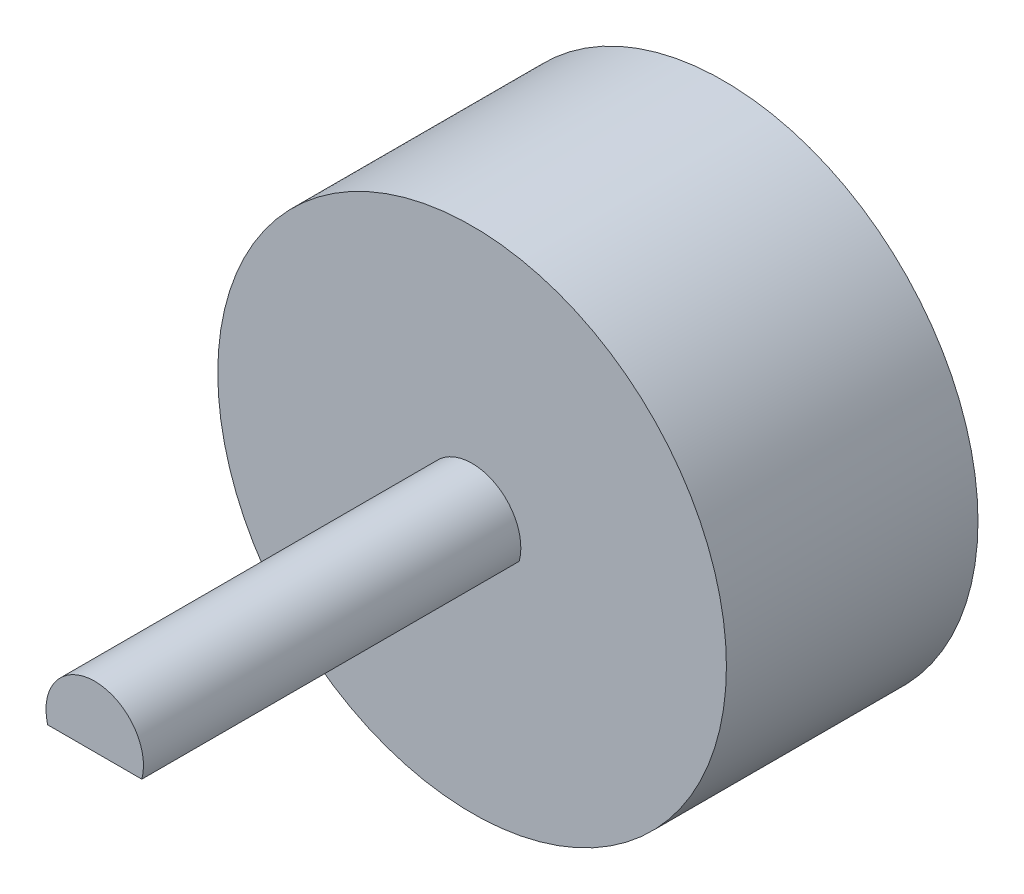
ISO-10303-21;
HEADER;
FILE_DESCRIPTION(('STEP AP214'),'2;1');
FILE_NAME('part.step','',(''),(''),'','','');
FILE_SCHEMA(('AUTOMOTIVE_DESIGN { 1 0 10303 214 1 1 1 1 }'));
ENDSEC;
DATA;
#1=APPLICATION_CONTEXT('core data for automotive mechanical design processes');
#2=APPLICATION_PROTOCOL_DEFINITION('international standard','automotive_design',2000,#1);
#3=PRODUCT_CONTEXT('',#1,'mechanical');
#4=PRODUCT('Part','Part','',(#3));
#5=PRODUCT_RELATED_PRODUCT_CATEGORY('part','',(#4));
#6=PRODUCT_DEFINITION_FORMATION('','',#4);
#7=PRODUCT_DEFINITION_CONTEXT('part definition',#1,'design');
#8=PRODUCT_DEFINITION('design','',#6,#7);
#9=PRODUCT_DEFINITION_SHAPE('','',#8);
#10=(LENGTH_UNIT() NAMED_UNIT(*) SI_UNIT(.MILLI.,.METRE.));
#11=(NAMED_UNIT(*) PLANE_ANGLE_UNIT() SI_UNIT($,.RADIAN.));
#12=(NAMED_UNIT(*) SI_UNIT($,.STERADIAN.) SOLID_ANGLE_UNIT());
#13=UNCERTAINTY_MEASURE_WITH_UNIT(LENGTH_MEASURE(1.E-05),#10,'distance_accuracy_value','');
#14=(GEOMETRIC_REPRESENTATION_CONTEXT(3) GLOBAL_UNCERTAINTY_ASSIGNED_CONTEXT((#13)) GLOBAL_UNIT_ASSIGNED_CONTEXT((#10,
#11,#12)) REPRESENTATION_CONTEXT('',''));
#15=CARTESIAN_POINT('',(0.,0.,0.));
#16=DIRECTION('',(0.,0.,1.));
#17=DIRECTION('',(1.,0.,0.));
#18=AXIS2_PLACEMENT_3D('',#15,#16,#17);
#19=CARTESIAN_POINT('',(0.,0.,16.));
#20=DIRECTION('',(0.,0.,1.));
#21=DIRECTION('',(1.,0.,0.));
#22=AXIS2_PLACEMENT_3D('',#19,#20,#21);
#23=PLANE('',#22);
#24=CARTESIAN_POINT('',(0.,0.,16.));
#25=DIRECTION('',(0.,0.,1.));
#26=DIRECTION('',(1.,0.,0.));
#27=AXIS2_PLACEMENT_3D('',#24,#25,#26);
#28=CIRCLE('',#27,16.175);
#29=CARTESIAN_POINT('',(16.175,0.,16.));
#30=VERTEX_POINT('',#29);
#31=EDGE_CURVE('E11',#30,#30,#28,.T.);
#32=ORIENTED_EDGE('',*,*,#31,.T.);
#33=EDGE_LOOP('',(#32));
#34=FACE_BOUND('',#33,.T.);
#35=DIRECTION('',(-1.,0.,0.));
#36=VECTOR('',#35,1.);
#37=CARTESIAN_POINT('',(0.,-0.799984374847408,16.));
#38=LINE('',#37,#36);
#39=CARTESIAN_POINT('',(2.995,-0.799984374847408,16.));
#40=VERTEX_POINT('',#39);
#41=CARTESIAN_POINT('',(-2.995,-0.799984374847408,16.));
#42=VERTEX_POINT('',#41);
#43=EDGE_CURVE('E53',#40,#42,#38,.T.);
#44=ORIENTED_EDGE('',*,*,#43,.T.);
#45=CARTESIAN_POINT('',(0.,0.,16.));
#46=DIRECTION('',(0.,0.,1.));
#47=DIRECTION('',(1.,0.,0.));
#48=AXIS2_PLACEMENT_3D('',#45,#46,#47);
#49=CIRCLE('',#48,3.1);
#50=EDGE_CURVE('E67',#40,#42,#49,.T.);
#51=ORIENTED_EDGE('',*,*,#50,.F.);
#52=EDGE_LOOP('',(#44,#51));
#53=FACE_BOUND('',#52,.T.);
#54=ADVANCED_FACE('F39',(#34,#53),#23,.T.);
#55=CARTESIAN_POINT('',(0.,0.,16.));
#56=DIRECTION('',(0.,0.,-1.));
#57=DIRECTION('',(-1.,0.,0.));
#58=AXIS2_PLACEMENT_3D('',#55,#56,#57);
#59=CYLINDRICAL_SURFACE('',#58,16.175);
#60=ORIENTED_EDGE('',*,*,#31,.F.);
#61=EDGE_LOOP('',(#60));
#62=FACE_BOUND('',#61,.T.);
#63=CARTESIAN_POINT('',(0.,0.,0.));
#64=DIRECTION('',(0.,0.,1.));
#65=DIRECTION('',(1.,0.,0.));
#66=AXIS2_PLACEMENT_3D('',#63,#64,#65);
#67=CIRCLE('',#66,16.175);
#68=CARTESIAN_POINT('',(16.175,0.,0.));
#69=VERTEX_POINT('',#68);
#70=EDGE_CURVE('E43',#69,#69,#67,.T.);
#71=ORIENTED_EDGE('',*,*,#70,.T.);
#72=EDGE_LOOP('',(#71));
#73=FACE_BOUND('',#72,.T.);
#74=ADVANCED_FACE('F41',(#62,#73),#59,.T.);
#75=CARTESIAN_POINT('',(0.,0.,0.));
#76=DIRECTION('',(0.,0.,1.));
#77=DIRECTION('',(1.,0.,0.));
#78=AXIS2_PLACEMENT_3D('',#75,#76,#77);
#79=PLANE('',#78);
#80=ORIENTED_EDGE('',*,*,#70,.F.);
#81=EDGE_LOOP('',(#80));
#82=FACE_BOUND('',#81,.T.);
#83=ADVANCED_FACE('F86',(#82),#79,.F.);
#84=CARTESIAN_POINT('',(0.,0.,40.));
#85=DIRECTION('',(0.,0.,-1.));
#86=DIRECTION('',(-1.,0.,0.));
#87=AXIS2_PLACEMENT_3D('',#84,#85,#86);
#88=CYLINDRICAL_SURFACE('',#87,3.1);
#89=ORIENTED_EDGE('',*,*,#50,.T.);
#90=DIRECTION('',(0.,0.,-1.));
#91=VECTOR('',#90,1.);
#92=CARTESIAN_POINT('',(-2.995,-0.799984374847408,40.));
#93=LINE('',#92,#91);
#94=CARTESIAN_POINT('',(-2.995,-0.799984374847408,40.));
#95=VERTEX_POINT('',#94);
#96=EDGE_CURVE('E74',#95,#42,#93,.T.);
#97=ORIENTED_EDGE('',*,*,#96,.F.);
#98=CARTESIAN_POINT('',(0.,0.,40.));
#99=DIRECTION('',(0.,0.,1.));
#100=DIRECTION('',(1.,0.,0.));
#101=AXIS2_PLACEMENT_3D('',#98,#99,#100);
#102=CIRCLE('',#101,3.1);
#103=CARTESIAN_POINT('',(2.995,-0.799984374847408,40.));
#104=VERTEX_POINT('',#103);
#105=EDGE_CURVE('E72',#104,#95,#102,.T.);
#106=ORIENTED_EDGE('',*,*,#105,.F.);
#107=DIRECTION('',(0.,0.,-1.));
#108=VECTOR('',#107,1.);
#109=CARTESIAN_POINT('',(2.995,-0.799984374847408,40.));
#110=LINE('',#109,#108);
#111=EDGE_CURVE('E61',#104,#40,#110,.T.);
#112=ORIENTED_EDGE('',*,*,#111,.T.);
#113=EDGE_LOOP('',(#89,#97,#106,#112));
#114=FACE_BOUND('',#113,.T.);
#115=ADVANCED_FACE('F71',(#114),#88,.T.);
#116=CARTESIAN_POINT('',(0.,-0.799984374847408,40.));
#117=DIRECTION('',(0.,-1.,0.));
#118=DIRECTION('',(0.,0.,-1.));
#119=AXIS2_PLACEMENT_3D('',#116,#117,#118);
#120=PLANE('',#119);
#121=ORIENTED_EDGE('',*,*,#43,.F.);
#122=ORIENTED_EDGE('',*,*,#111,.F.);
#123=DIRECTION('',(-1.,0.,0.));
#124=VECTOR('',#123,1.);
#125=CARTESIAN_POINT('',(0.,-0.799984374847408,40.));
#126=LINE('',#125,#124);
#127=EDGE_CURVE('E75',#104,#95,#126,.T.);
#128=ORIENTED_EDGE('',*,*,#127,.T.);
#129=ORIENTED_EDGE('',*,*,#96,.T.);
#130=EDGE_LOOP('',(#121,#122,#128,#129));
#131=FACE_BOUND('',#130,.T.);
#132=ADVANCED_FACE('F77',(#131),#120,.T.);
#133=CARTESIAN_POINT('',(0.,0.,40.));
#134=DIRECTION('',(0.,0.,1.));
#135=DIRECTION('',(1.,0.,0.));
#136=AXIS2_PLACEMENT_3D('',#133,#134,#135);
#137=PLANE('',#136);
#138=ORIENTED_EDGE('',*,*,#105,.T.);
#139=ORIENTED_EDGE('',*,*,#127,.F.);
#140=EDGE_LOOP('',(#138,#139));
#141=FACE_BOUND('',#140,.T.);
#142=ADVANCED_FACE('F102',(#141),#137,.T.);
#143=CLOSED_SHELL('',(#54,#74,#83,#115,#132,#142));
#144=MANIFOLD_SOLID_BREP('B2',#143);
#145=ADVANCED_BREP_SHAPE_REPRESENTATION('',(#18,#144),#14);
#146=SHAPE_DEFINITION_REPRESENTATION(#9,#145);
ENDSEC;
END-ISO-10303-21;
